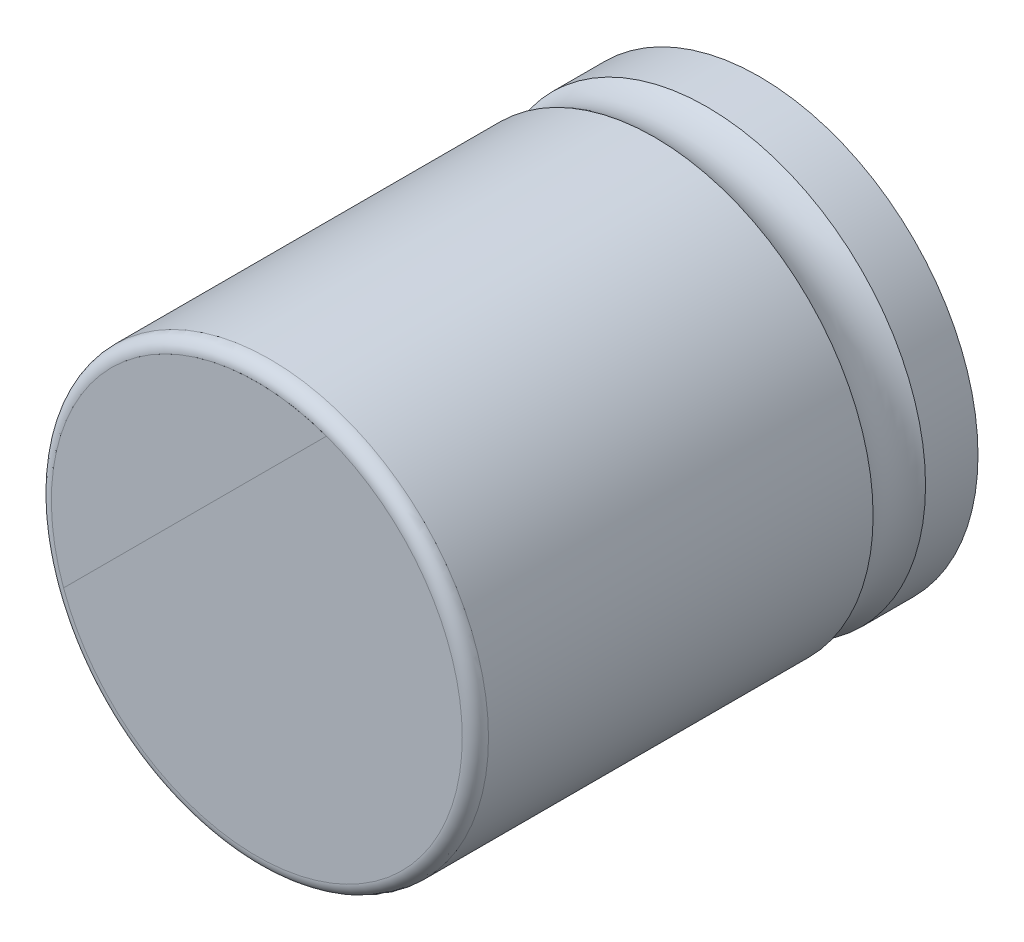
ISO-10303-21;
HEADER;
FILE_DESCRIPTION(('STEP AP214'),'2;1');
FILE_NAME('part.step','',(''),(''),'','','');
FILE_SCHEMA(('AUTOMOTIVE_DESIGN { 1 0 10303 214 1 1 1 1 }'));
ENDSEC;
DATA;
#1=APPLICATION_CONTEXT('core data for automotive mechanical design processes');
#2=APPLICATION_PROTOCOL_DEFINITION('international standard','automotive_design',2000,#1);
#3=PRODUCT_CONTEXT('',#1,'mechanical');
#4=PRODUCT('Part','Part','',(#3));
#5=PRODUCT_RELATED_PRODUCT_CATEGORY('part','',(#4));
#6=PRODUCT_DEFINITION_FORMATION('','',#4);
#7=PRODUCT_DEFINITION_CONTEXT('part definition',#1,'design');
#8=PRODUCT_DEFINITION('design','',#6,#7);
#9=PRODUCT_DEFINITION_SHAPE('','',#8);
#10=(LENGTH_UNIT() NAMED_UNIT(*) SI_UNIT(.MILLI.,.METRE.));
#11=(NAMED_UNIT(*) PLANE_ANGLE_UNIT() SI_UNIT($,.RADIAN.));
#12=(NAMED_UNIT(*) SI_UNIT($,.STERADIAN.) SOLID_ANGLE_UNIT());
#13=UNCERTAINTY_MEASURE_WITH_UNIT(LENGTH_MEASURE(1.E-05),#10,'distance_accuracy_value','');
#14=(GEOMETRIC_REPRESENTATION_CONTEXT(3) GLOBAL_UNCERTAINTY_ASSIGNED_CONTEXT((#13)) GLOBAL_UNIT_ASSIGNED_CONTEXT((#10,
#11,#12)) REPRESENTATION_CONTEXT('',''));
#15=CARTESIAN_POINT('',(0.,0.,0.));
#16=DIRECTION('',(0.,0.,1.));
#17=DIRECTION('',(1.,0.,0.));
#18=AXIS2_PLACEMENT_3D('',#15,#16,#17);
#19=CARTESIAN_POINT('',(8.34720518814799,-10.7690277297925,3.050316059209));
#20=DIRECTION('',(-3.09086346086632E-08,-3.09086341954809E-08,-1.));
#21=DIRECTION('',(-0.707106781186547,-0.707106781186547,4.37114099658419E-08));
#22=AXIS2_PLACEMENT_3D('',#19,#20,#21);
#23=PLANE('',#22);
#24=CARTESIAN_POINT('',(8.34720518814799,-10.7690277297925,3.050316059209));
#25=DIRECTION('',(-3.09086346086632E-08,-3.09086341954809E-08,-1.));
#26=DIRECTION('',(-0.707106781186548,0.707106781186548,0.));
#27=AXIS2_PLACEMENT_3D('',#24,#25,#26);
#28=CIRCLE('',#27,5.);
#29=CARTESIAN_POINT('',(4.81167128221525,-7.23349382385976,3.050316059209));
#30=VERTEX_POINT('',#29);
#31=EDGE_CURVE('E11',#30,#30,#28,.T.);
#32=ORIENTED_EDGE('',*,*,#31,.T.);
#33=EDGE_LOOP('',(#32));
#34=FACE_BOUND('',#33,.T.);
#35=ADVANCED_FACE('F17',(#34),#23,.T.);
#36=CARTESIAN_POINT('',(8.34720537205436,-10.7690275458861,9.000316059209));
#37=DIRECTION('',(-3.09086346086632E-08,-3.09086341954809E-08,-1.));
#38=DIRECTION('',(-0.707106781186548,0.707106781186548,0.));
#39=AXIS2_PLACEMENT_3D('',#36,#37,#38);
#40=CYLINDRICAL_SURFACE('',#39,5.);
#41=ORIENTED_EDGE('',*,*,#31,.F.);
#42=EDGE_LOOP('',(#41));
#43=FACE_BOUND('',#42,.T.);
#44=CARTESIAN_POINT('',(8.34720522523835,-10.7690276927021,4.25031605920913));
#45=DIRECTION('',(-3.09086346086632E-08,-3.09086341954809E-08,-1.));
#46=DIRECTION('',(0.707106781186548,-0.707106781186548,0.));
#47=AXIS2_PLACEMENT_3D('',#44,#45,#46);
#48=CIRCLE('',#47,5.);
#49=CARTESIAN_POINT('',(11.8827391311711,-14.3045615986349,4.25031605920912));
#50=VERTEX_POINT('',#49);
#51=EDGE_CURVE('E28',#50,#50,#48,.T.);
#52=ORIENTED_EDGE('',*,*,#51,.T.);
#53=EDGE_LOOP('',(#52));
#54=FACE_BOUND('',#53,.T.);
#55=ADVANCED_FACE('F105',(#43,#54),#40,.T.);
#56=CARTESIAN_POINT('',(8.34720524378355,-10.7690276741569,4.850316059209));
#57=DIRECTION('',(-3.09086346086632E-08,-3.09086341954809E-08,-1.));
#58=DIRECTION('',(-0.707106781186547,-0.707106781186547,4.37114099658419E-08));
#59=AXIS2_PLACEMENT_3D('',#56,#57,#58);
#60=TOROIDAL_SURFACE('',#59,5.941071428571,1.116071428571);
#61=CARTESIAN_POINT('',(8.34720526232871,-10.7690276556118,5.450316059209));
#62=DIRECTION('',(-3.09086346086632E-08,-3.09086341954809E-08,-1.));
#63=DIRECTION('',(-0.707106781186548,0.707106781186548,0.));
#64=AXIS2_PLACEMENT_3D('',#61,#62,#63);
#65=CIRCLE('',#64,5.);
#66=CARTESIAN_POINT('',(4.81167135639597,-7.23349374967902,5.450316059209));
#67=VERTEX_POINT('',#66);
#68=EDGE_CURVE('E87',#67,#67,#65,.T.);
#69=ORIENTED_EDGE('',*,*,#68,.T.);
#70=EDGE_LOOP('',(#69));
#71=FACE_BOUND('',#70,.T.);
#72=ORIENTED_EDGE('',*,*,#51,.F.);
#73=EDGE_LOOP('',(#72));
#74=FACE_BOUND('',#73,.T.);
#75=ADVANCED_FACE('F111',(#71,#74),#60,.F.);
#76=ORIENTED_EDGE('',*,*,#68,.F.);
#77=EDGE_LOOP('',(#76));
#78=FACE_BOUND('',#77,.T.);
#79=CARTESIAN_POINT('',(8.34720553432469,-10.7690273836158,14.250316059209));
#80=DIRECTION('',(3.09086345995963E-08,3.09086342045479E-08,1.));
#81=DIRECTION('',(1.,0.,-3.09086345995963E-08));
#82=AXIS2_PLACEMENT_3D('',#79,#80,#81);
#83=CIRCLE('',#82,5.);
#84=CARTESIAN_POINT('',(13.3472055343247,-10.7690273836158,14.2503159046658));
#85=VERTEX_POINT('',#84);
#86=EDGE_CURVE('E21',#85,#85,#83,.T.);
#87=ORIENTED_EDGE('',*,*,#86,.F.);
#88=EDGE_LOOP('',(#87));
#89=FACE_BOUND('',#88,.T.);
#90=ADVANCED_FACE('F113',(#78,#89),#40,.T.);
#91=CARTESIAN_POINT('',(8.34720553432469,-10.7690273836158,14.250316059209));
#92=DIRECTION('',(3.09086345995963E-08,3.09086342045479E-08,1.));
#93=DIRECTION('',(1.,0.,-3.09086345995963E-08));
#94=AXIS2_PLACEMENT_3D('',#91,#92,#93);
#95=TOROIDAL_SURFACE('',#94,4.7,0.3);
#96=ORIENTED_EDGE('',*,*,#86,.T.);
#97=EDGE_LOOP('',(#96));
#98=FACE_BOUND('',#97,.T.);
#99=CARTESIAN_POINT('',(8.34720554359728,-10.7690273743432,14.550316059209));
#100=DIRECTION('',(-3.09086345995963E-08,-3.09086342045479E-08,-1.));
#101=DIRECTION('',(-1.,0.,3.09086345995963E-08));
#102=AXIS2_PLACEMENT_3D('',#99,#100,#101);
#103=CIRCLE('',#102,4.7);
#104=CARTESIAN_POINT('',(3.92550133285993,-12.3623044603351,14.5503162451238));
#105=VERTEX_POINT('',#104);
#106=CARTESIAN_POINT('',(9.94048262958858,-6.34732316360572,14.5503158732941));
#107=VERTEX_POINT('',#106);
#108=EDGE_CURVE('E57',#105,#107,#103,.T.);
#109=ORIENTED_EDGE('',*,*,#108,.T.);
#110=CARTESIAN_POINT('',(8.34720554359728,-10.7690273743432,14.550316059209));
#111=DIRECTION('',(3.09086345995963E-08,3.09086342045479E-08,1.));
#112=DIRECTION('',(1.,0.,-3.09086345995963E-08));
#113=AXIS2_PLACEMENT_3D('',#110,#111,#112);
#114=CIRCLE('',#113,4.7);
#115=EDGE_CURVE('E51',#107,#105,#114,.F.);
#116=ORIENTED_EDGE('',*,*,#115,.T.);
#117=EDGE_LOOP('',(#109,#116));
#118=FACE_BOUND('',#117,.T.);
#119=ADVANCED_FACE('F19',(#98,#118),#95,.T.);
#120=CARTESIAN_POINT('',(6.33086873004909,-8.75269056079501,14.550316059209));
#121=DIRECTION('',(3.09086345995963E-08,3.09086342045479E-08,1.));
#122=DIRECTION('',(0.707106781186547,0.707106781186547,-4.37114099658419E-08));
#123=AXIS2_PLACEMENT_3D('',#120,#121,#122);
#124=PLANE('',#123);
#125=DIRECTION('',(-0.707106781186547,-0.707106781186547,4.37114099658419E-08));
#126=VECTOR('',#125,1.);
#127=CARTESIAN_POINT('',(3.92550133285993,-12.3623044603344,14.5503162451238));
#128=LINE('',#127,#126);
#129=EDGE_CURVE('E60',#107,#105,#128,.T.);
#130=ORIENTED_EDGE('',*,*,#129,.T.);
#131=ORIENTED_EDGE('',*,*,#115,.F.);
#132=EDGE_LOOP('',(#130,#131));
#133=FACE_BOUND('',#132,.T.);
#134=ADVANCED_FACE('F62',(#133),#124,.T.);
#135=CARTESIAN_POINT('',(6.33086873008001,-8.7526905607641,14.551316059209));
#136=DIRECTION('',(3.09086345995963E-08,3.09086342045479E-08,1.));
#137=DIRECTION('',(0.707106781186547,0.707106781186547,-4.37114099658419E-08));
#138=AXIS2_PLACEMENT_3D('',#135,#136,#137);
#139=PLANE('',#138);
#140=DIRECTION('',(0.707106781186547,0.707106781186547,-4.37114099658419E-08));
#141=VECTOR('',#140,1.);
#142=CARTESIAN_POINT('',(6.9329919812551,-9.35481381193919,14.551316059209));
#143=LINE('',#142,#141);
#144=CARTESIAN_POINT('',(3.92550133289084,-12.3623044603035,14.5513162451238));
#145=VERTEX_POINT('',#144);
#146=CARTESIAN_POINT('',(9.94048262961937,-6.34732316357494,14.5513158732941));
#147=VERTEX_POINT('',#146);
#148=EDGE_CURVE('E40',#145,#147,#143,.T.);
#149=ORIENTED_EDGE('',*,*,#148,.T.);
#150=CARTESIAN_POINT('',(8.34720554362821,-10.7690273743123,14.551316059209));
#151=DIRECTION('',(3.09086345995963E-08,3.09086342045479E-08,1.));
#152=DIRECTION('',(1.,0.,-3.09086345995963E-08));
#153=AXIS2_PLACEMENT_3D('',#150,#151,#152);
#154=CIRCLE('',#153,4.7);
#155=EDGE_CURVE('E74',#147,#145,#154,.T.);
#156=ORIENTED_EDGE('',*,*,#155,.T.);
#157=EDGE_LOOP('',(#149,#156));
#158=FACE_BOUND('',#157,.T.);
#159=ADVANCED_FACE('F94',(#158),#139,.T.);
#160=CARTESIAN_POINT('',(3.92550127104266,-12.3623045221516,12.5503162451239));
#161=DIRECTION('',(0.707106781186548,-0.707106781186548,0.));
#162=DIRECTION('',(0.707106781186547,0.707106781186547,-4.37114099658419E-08));
#163=AXIS2_PLACEMENT_3D('',#160,#161,#162);
#164=PLANE('',#163);
#165=ORIENTED_EDGE('',*,*,#129,.F.);
#166=DIRECTION('',(3.09086344020721E-08,3.09086344020721E-08,1.));
#167=VECTOR('',#166,1.);
#168=CARTESIAN_POINT('',(9.94048256777119,-6.34732322542311,12.5503158732941));
#169=LINE('',#168,#167);
#170=EDGE_CURVE('E66',#107,#147,#169,.T.);
#171=ORIENTED_EDGE('',*,*,#170,.T.);
#172=ORIENTED_EDGE('',*,*,#148,.F.);
#173=DIRECTION('',(3.09086344020721E-08,3.09086344020721E-08,1.));
#174=VECTOR('',#173,1.);
#175=CARTESIAN_POINT('',(3.92550127104266,-12.3623045221516,12.5503162451239));
#176=LINE('',#175,#174);
#177=EDGE_CURVE('E69',#105,#145,#176,.T.);
#178=ORIENTED_EDGE('',*,*,#177,.F.);
#179=EDGE_LOOP('',(#165,#171,#172,#178));
#180=FACE_BOUND('',#179,.T.);
#181=ADVANCED_FACE('F70',(#180),#164,.T.);
#182=CARTESIAN_POINT('',(8.34720548178003,-10.7690274361605,12.550316059209));
#183=DIRECTION('',(3.09086344020721E-08,3.09086344020721E-08,1.));
#184=DIRECTION('',(-0.707106781186548,0.707106781186548,0.));
#185=AXIS2_PLACEMENT_3D('',#182,#183,#184);
#186=CYLINDRICAL_SURFACE('',#185,4.7);
#187=ORIENTED_EDGE('',*,*,#108,.F.);
#188=ORIENTED_EDGE('',*,*,#177,.T.);
#189=ORIENTED_EDGE('',*,*,#155,.F.);
#190=ORIENTED_EDGE('',*,*,#170,.F.);
#191=EDGE_LOOP('',(#187,#188,#189,#190));
#192=FACE_BOUND('',#191,.T.);
#193=ADVANCED_FACE('F76',(#192),#186,.T.);
#194=CLOSED_SHELL('',(#35,#55,#75,#90,#119,#134,#159,#181,#193));
#195=MANIFOLD_SOLID_BREP('B1',#194);
#196=ADVANCED_BREP_SHAPE_REPRESENTATION('',(#18,#195),#14);
#197=SHAPE_DEFINITION_REPRESENTATION(#9,#196);
ENDSEC;
END-ISO-10303-21;
